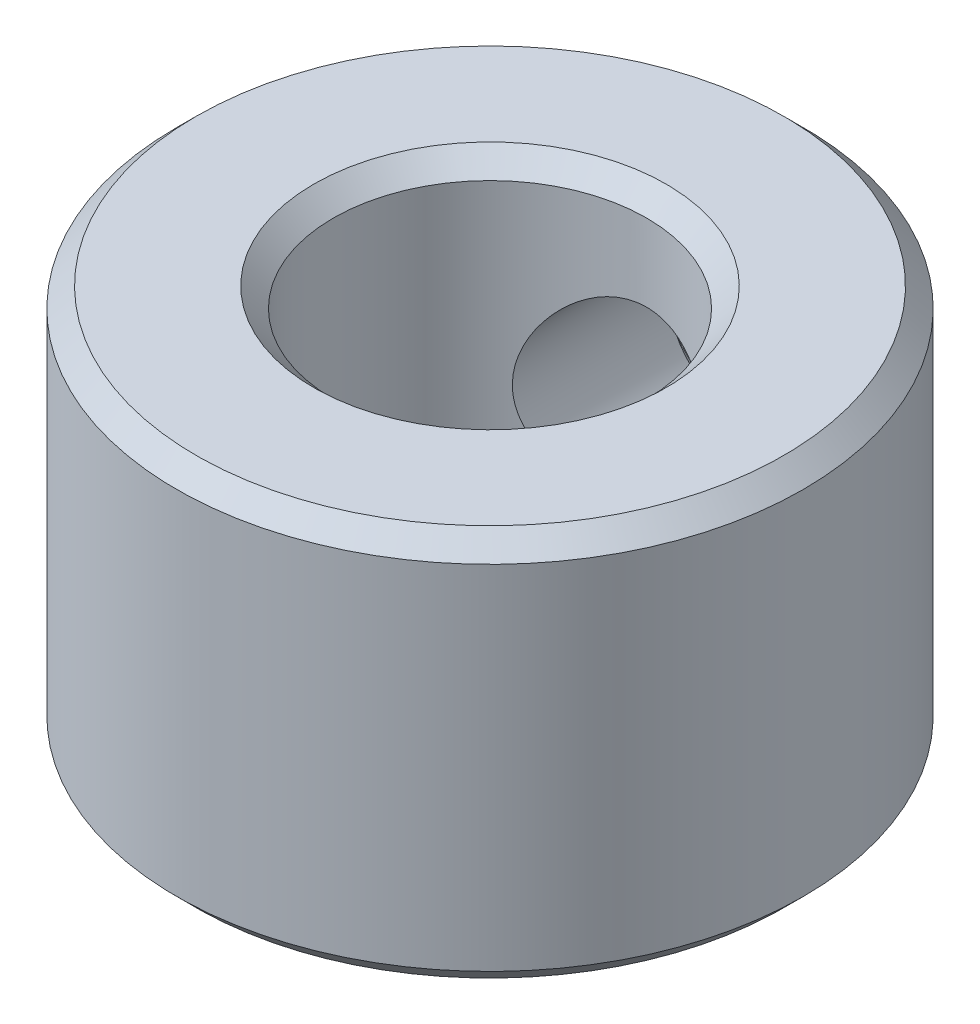
ISO-10303-21;
HEADER;
FILE_DESCRIPTION(('STEP AP214'),'2;1');
FILE_NAME('part.step','',(''),(''),'','','');
FILE_SCHEMA(('AUTOMOTIVE_DESIGN { 1 0 10303 214 1 1 1 1 }'));
ENDSEC;
DATA;
#1=APPLICATION_CONTEXT('core data for automotive mechanical design processes');
#2=APPLICATION_PROTOCOL_DEFINITION('international standard','automotive_design',2000,#1);
#3=PRODUCT_CONTEXT('',#1,'mechanical');
#4=PRODUCT('Part','Part','',(#3));
#5=PRODUCT_RELATED_PRODUCT_CATEGORY('part','',(#4));
#6=PRODUCT_DEFINITION_FORMATION('','',#4);
#7=PRODUCT_DEFINITION_CONTEXT('part definition',#1,'design');
#8=PRODUCT_DEFINITION('design','',#6,#7);
#9=PRODUCT_DEFINITION_SHAPE('','',#8);
#10=(LENGTH_UNIT() NAMED_UNIT(*) SI_UNIT(.MILLI.,.METRE.));
#11=(NAMED_UNIT(*) PLANE_ANGLE_UNIT() SI_UNIT($,.RADIAN.));
#12=(NAMED_UNIT(*) SI_UNIT($,.STERADIAN.) SOLID_ANGLE_UNIT());
#13=UNCERTAINTY_MEASURE_WITH_UNIT(LENGTH_MEASURE(1.E-05),#10,'distance_accuracy_value','');
#14=(GEOMETRIC_REPRESENTATION_CONTEXT(3) GLOBAL_UNCERTAINTY_ASSIGNED_CONTEXT((#13)) GLOBAL_UNIT_ASSIGNED_CONTEXT((#10,
#11,#12)) REPRESENTATION_CONTEXT('',''));
#15=CARTESIAN_POINT('',(0.,0.,0.));
#16=DIRECTION('',(0.,0.,1.));
#17=DIRECTION('',(1.,0.,0.));
#18=AXIS2_PLACEMENT_3D('',#15,#16,#17);
#19=CARTESIAN_POINT('',(0.,4.875,0.));
#20=DIRECTION('',(0.,1.,0.));
#21=DIRECTION('',(1.,0.,0.));
#22=AXIS2_PLACEMENT_3D('',#19,#20,#21);
#23=CONICAL_SURFACE('',#22,2.125,0.785398163397448);
#24=CARTESIAN_POINT('',(0.,5.,0.));
#25=DIRECTION('',(0.,1.,0.));
#26=DIRECTION('',(1.,0.,0.));
#27=AXIS2_PLACEMENT_3D('',#24,#25,#26);
#28=CIRCLE('',#27,2.25);
#29=CARTESIAN_POINT('',(-2.25,5.,0.));
#30=VERTEX_POINT('',#29);
#31=EDGE_CURVE('E202',#30,#30,#28,.T.);
#32=ORIENTED_EDGE('',*,*,#31,.T.);
#33=DIRECTION('',(0.707106781186547,-0.707106781186548,0.));
#34=VECTOR('',#33,1.);
#35=CARTESIAN_POINT('',(-2.125,4.875,0.));
#36=LINE('',#35,#34);
#37=CARTESIAN_POINT('',(-2.,4.75,0.));
#38=VERTEX_POINT('',#37);
#39=EDGE_CURVE('E11',#30,#38,#36,.T.);
#40=ORIENTED_EDGE('',*,*,#39,.T.);
#41=CARTESIAN_POINT('',(0.,4.75,0.));
#42=DIRECTION('',(0.,-1.,0.));
#43=DIRECTION('',(1.,0.,0.));
#44=AXIS2_PLACEMENT_3D('',#41,#42,#43);
#45=CIRCLE('',#44,2.);
#46=EDGE_CURVE('E208',#38,#38,#45,.T.);
#47=ORIENTED_EDGE('',*,*,#46,.T.);
#48=ORIENTED_EDGE('',*,*,#39,.F.);
#49=EDGE_LOOP('',(#32,#40,#47,#48));
#50=FACE_BOUND('',#49,.T.);
#51=ADVANCED_FACE('F17',(#50),#23,.F.);
#52=CARTESIAN_POINT('',(0.,0.,0.));
#53=DIRECTION('',(0.,1.,0.));
#54=DIRECTION('',(1.,0.,0.));
#55=AXIS2_PLACEMENT_3D('',#52,#53,#54);
#56=CYLINDRICAL_SURFACE('',#55,2.);
#57=CARTESIAN_POINT('',(1.2645,2.5,-1.54952888001483));
#58=CARTESIAN_POINT('',(1.26449411796691,2.43735012324644,-1.54953832528692));
#59=CARTESIAN_POINT('',(1.25980123596175,2.37460998732213,-1.55340009895582));
#60=CARTESIAN_POINT('',(1.24137298283824,2.25126618343794,-1.56815840057098));
#61=CARTESIAN_POINT('',(1.22761427551083,2.19066845550868,-1.57907308189968));
#62=CARTESIAN_POINT('',(1.19205271815077,2.07376857766439,-1.60608182446035));
#63=CARTESIAN_POINT('',(1.17032101939601,2.01743359363941,-1.62212991738661));
#64=CARTESIAN_POINT('',(1.11963684574248,1.90928453446939,-1.65751838322308));
#65=CARTESIAN_POINT('',(1.09068388775742,1.85747076209657,-1.67685897636678));
#66=CARTESIAN_POINT('',(1.02173617894958,1.75199397208212,-1.71986123397177));
#67=CARTESIAN_POINT('',(0.980769943374188,1.69905883131843,-1.7437511823403));
#68=CARTESIAN_POINT('',(0.89093919554735,1.6001925381209,-1.79131669705349));
#69=CARTESIAN_POINT('',(0.842067766194926,1.55426758868601,-1.81499205629592));
#70=CARTESIAN_POINT('',(0.730451803901077,1.465052650476,-1.86294646109463));
#71=CARTESIAN_POINT('',(0.666737528883957,1.42280305888443,-1.88693350492434));
#72=CARTESIAN_POINT('',(0.531298337879028,1.34996747456659,-1.92944044111025));
#73=CARTESIAN_POINT('',(0.459581610447951,1.31936969802778,-1.9479658526651));
#74=CARTESIAN_POINT('',(0.318000809823785,1.27412401821854,-1.97573486186531));
#75=CARTESIAN_POINT('',(0.248713007533473,1.25815324205258,-1.98574058327142));
#76=CARTESIAN_POINT('',(0.107801673786748,1.23810190006417,-1.99833990319646));
#77=CARTESIAN_POINT('',(0.0361807627911929,1.23400843009899,-2.00094154584486));
#78=CARTESIAN_POINT('',(-0.0967328525311562,1.23769823411709,-1.99861152687371));
#79=CARTESIAN_POINT('',(-0.158094030613458,1.24392864060202,-1.99466473631825));
#80=CARTESIAN_POINT('',(-0.278694570481386,1.26507623336505,-1.98141571029734));
#81=CARTESIAN_POINT('',(-0.337933771771026,1.27999407525198,-1.97211307064624));
#82=CARTESIAN_POINT('',(-0.452914762909885,1.31784031499373,-1.9489274314289));
#83=CARTESIAN_POINT('',(-0.508651031986307,1.34078100131795,-1.9350374072614));
#84=CARTESIAN_POINT('',(-0.615518921331753,1.39380889945209,-1.90374389911779));
#85=CARTESIAN_POINT('',(-0.66664952948229,1.42389767683448,-1.88633964558184));
#86=CARTESIAN_POINT('',(-0.769757581284988,1.49460510074034,-1.84685964638113));
#87=CARTESIAN_POINT('',(-0.821032566750792,1.53607218519547,-1.82447166495386));
#88=CARTESIAN_POINT('',(-0.916345547494313,1.62616876997324,-1.77851561123726));
#89=CARTESIAN_POINT('',(-0.960372651636247,1.67480884469536,-1.75494583119227));
#90=CARTESIAN_POINT('',(-1.04598643244538,1.78556668533021,-1.70548199944205));
#91=CARTESIAN_POINT('',(-1.08644277160218,1.84861743719009,-1.67970330352267));
#92=CARTESIAN_POINT('',(-1.15604990573414,1.98216587136297,-1.63258088815751));
#93=CARTESIAN_POINT('',(-1.1852213789095,2.05264962893361,-1.61122909058669));
#94=CARTESIAN_POINT('',(-1.2246161450688,2.17992201583035,-1.58137778507439));
#95=CARTESIAN_POINT('',(-1.23781972955308,2.23533731102721,-1.57096854929203));
#96=CARTESIAN_POINT('',(-1.2566505024441,2.34817824878922,-1.55594978135884));
#97=CARTESIAN_POINT('',(-1.26228851443341,2.40560089853876,-1.55133196441425));
#98=CARTESIAN_POINT('',(-1.26564578829317,2.52098806068944,-1.54859515876369));
#99=CARTESIAN_POINT('',(-1.26334448419211,2.57895359188928,-1.55049304825479));
#100=CARTESIAN_POINT('',(-1.25093577610471,2.69350884817042,-1.56051880729487));
#101=CARTESIAN_POINT('',(-1.24082186157763,2.75009738516122,-1.56865187280686));
#102=CARTESIAN_POINT('',(-1.21366943674918,2.85925861904806,-1.58974532293077));
#103=CARTESIAN_POINT('',(-1.1967843787254,2.91189147657731,-1.60259823220519));
#104=CARTESIAN_POINT('',(-1.15675412768388,3.01368807254575,-1.63172650488258));
#105=CARTESIAN_POINT('',(-1.1336067386191,3.06285058637963,-1.64800306843138));
#106=CARTESIAN_POINT('',(-1.07658218628269,3.16638258759106,-1.68592855061878));
#107=CARTESIAN_POINT('',(-1.04149675234294,3.21992850889003,-1.70800822887954));
#108=CARTESIAN_POINT('',(-0.963864401793085,3.32096981729384,-1.75299258821368));
#109=CARTESIAN_POINT('',(-0.921309629627182,3.36845874251176,-1.77589811748598));
#110=CARTESIAN_POINT('',(-0.821420704703212,3.46425733392833,-1.82451368153187));
#111=CARTESIAN_POINT('',(-0.762803985042327,3.51133859050659,-1.8500399732252));
#112=CARTESIAN_POINT('',(-0.636990044557513,3.59494194218451,-1.8970357779525));
#113=CARTESIAN_POINT('',(-0.569796236109793,3.6314682178001,-1.91850689595041));
#114=CARTESIAN_POINT('',(-0.432254308912909,3.69054688083504,-1.95394855830421));
#115=CARTESIAN_POINT('',(-0.362282006019539,3.7137564589949,-1.96826622926783));
#116=CARTESIAN_POINT('',(-0.218314556068939,3.74769609803434,-1.98937292908515));
#117=CARTESIAN_POINT('',(-0.144325456886686,3.75844440401708,-1.99617296416441));
#118=CARTESIAN_POINT('',(-0.00665707801373274,3.76606929450586,-2.00099185098277));
#119=CARTESIAN_POINT('',(0.0568858046173655,3.76480085080471,-2.0001850416096));
#120=CARTESIAN_POINT('',(0.182709540069951,3.75282403612561,-1.99263276935113));
#121=CARTESIAN_POINT('',(0.244990477096484,3.74211629713365,-1.98588770404796));
#122=CARTESIAN_POINT('',(0.364008255181647,3.712464633797,-1.96748125913666));
#123=CARTESIAN_POINT('',(0.420867567149991,3.6938735435709,-1.95603107711261));
#124=CARTESIAN_POINT('',(0.530593796569564,3.64932134254513,-1.92916148883134));
#125=CARTESIAN_POINT('',(0.58346008343398,3.62335907074123,-1.91374145733531));
#126=CARTESIAN_POINT('',(0.68954176175382,3.56189672046674,-1.8782890840866));
#127=CARTESIAN_POINT('',(0.742245311387839,3.52569494478695,-1.85794707932388));
#128=CARTESIAN_POINT('',(0.841195569530736,3.44624724224734,-1.81529603663499));
#129=CARTESIAN_POINT('',(0.887435048339554,3.40299354345176,-1.79298484104648));
#130=CARTESIAN_POINT('',(0.979270491623404,3.3032714453577,-1.7447348464483));
#131=CARTESIAN_POINT('',(1.02375166101236,3.24579451602162,-1.71874926626124));
#132=CARTESIAN_POINT('',(1.10261752614741,3.12329097722003,-1.66925222113531));
#133=CARTESIAN_POINT('',(1.1370067814702,3.05826779577634,-1.64573964197263));
#134=CARTESIAN_POINT('',(1.18818249135166,2.93651580305712,-1.60903404622307));
#135=CARTESIAN_POINT('',(1.20717019521899,2.88105495048418,-1.59470883609959));
#136=CARTESIAN_POINT('',(1.23737203476855,2.76706109813201,-1.57139495785571));
#137=CARTESIAN_POINT('',(1.24861010049216,2.70853816143648,-1.56238987421431));
#138=CARTESIAN_POINT('',(1.25859624043419,2.62456942414068,-1.55433160058593));
#139=CARTESIAN_POINT('',(1.26080597808091,2.59974838666082,-1.55253745914827));
#140=CARTESIAN_POINT('',(1.26375922886068,2.54995637712227,-1.5501340553494));
#141=CARTESIAN_POINT('',(1.26450234581071,2.52498536637754,-1.54952511315053));
#142=CARTESIAN_POINT('',(1.2645,2.5,-1.54952888001483));
#143=B_SPLINE_CURVE_WITH_KNOTS('',3,(#57,#58,#59,#60,#61,#62,#63,#64,#65,#66,#67,#68,#69,#70,
#71,#72,#73,#74,#75,#76,#77,#78,#79,#80,#81,#82,#83,#84,#85,#86,#87,#88,#89,#90,#91,#92,#93,#94,
#95,#96,#97,#98,#99,#100,#101,#102,#103,#104,#105,#106,#107,#108,#109,#110,#111,#112,#113,#114,
#115,#116,#117,#118,#119,#120,#121,#122,#123,#124,#125,#126,#127,#128,#129,#130,#131,#132,#133,
#134,#135,#136,#137,#138,#139,#140,#141,#142),.UNSPECIFIED.,.T.,.F.,(4,2,2,2,2,2,2,2,2,2,2,2,2,
2,2,2,2,2,2,2,2,2,2,2,2,2,2,2,2,2,2,2,2,2,2,2,2,2,2,2,2,2,4),(0.,0.187834998618613,
0.376155399361165,0.562834551812605,0.74952619603823,0.96192621140118,1.17451309377345,
1.41357454197133,1.65239357434149,1.86649900785851,2.08037173848349,2.26489251750059,
2.44942722342765,2.63424582532583,2.81910494351061,3.02721650045857,3.23563797985774,
3.47217432561049,3.70827516954924,3.88128567913113,4.05404840877014,4.2272589979291,
4.40061408588117,4.57024443479238,4.73993434621561,4.94234058954809,5.14496099459186,
5.38196739397222,5.618879793056,5.84278297062728,6.06635790592645,6.25605905235322,
6.44574749874689,6.62771803900912,6.80971725661148,7.01023551077349,7.21097626913794,
7.44152072744398,7.67196086369056,7.85232662520503,8.03213291238308,8.10702306777426,
8.18193345071839),.UNSPECIFIED.);
#144=CARTESIAN_POINT('',(-1.2645,2.5,-1.54952888001483));
#145=VERTEX_POINT('',#144);
#146=EDGE_CURVE('E96',#145,#145,#143,.T.);
#147=ORIENTED_EDGE('',*,*,#146,.T.);
#148=EDGE_LOOP('',(#147));
#149=FACE_BOUND('',#148,.T.);
#150=ORIENTED_EDGE('',*,*,#46,.F.);
#151=DIRECTION('',(0.,-1.,0.));
#152=VECTOR('',#151,1.);
#153=CARTESIAN_POINT('',(-2.,0.,0.));
#154=LINE('',#153,#152);
#155=CARTESIAN_POINT('',(-2.,0.25,0.));
#156=VERTEX_POINT('',#155);
#157=EDGE_CURVE('E28',#38,#156,#154,.T.);
#158=ORIENTED_EDGE('',*,*,#157,.T.);
#159=CARTESIAN_POINT('',(0.,0.25,0.));
#160=DIRECTION('',(0.,1.,0.));
#161=DIRECTION('',(1.,0.,0.));
#162=AXIS2_PLACEMENT_3D('',#159,#160,#161);
#163=CIRCLE('',#162,2.);
#164=EDGE_CURVE('E198',#156,#156,#163,.T.);
#165=ORIENTED_EDGE('',*,*,#164,.F.);
#166=ORIENTED_EDGE('',*,*,#157,.F.);
#167=EDGE_LOOP('',(#150,#158,#165,#166));
#168=FACE_BOUND('',#167,.T.);
#169=ADVANCED_FACE('F19',(#149,#168),#56,.F.);
#170=CARTESIAN_POINT('',(0.,0.125,0.));
#171=DIRECTION('',(0.,-1.,0.));
#172=DIRECTION('',(1.,0.,0.));
#173=AXIS2_PLACEMENT_3D('',#170,#171,#172);
#174=CONICAL_SURFACE('',#173,2.125,0.785398163397448);
#175=ORIENTED_EDGE('',*,*,#164,.T.);
#176=DIRECTION('',(-0.707106781186547,-0.707106781186548,0.));
#177=VECTOR('',#176,1.);
#178=CARTESIAN_POINT('',(-2.125,0.125,0.));
#179=LINE('',#178,#177);
#180=CARTESIAN_POINT('',(-2.25,0.,0.));
#181=VERTEX_POINT('',#180);
#182=EDGE_CURVE('E200',#156,#181,#179,.T.);
#183=ORIENTED_EDGE('',*,*,#182,.T.);
#184=CARTESIAN_POINT('',(0.,0.,0.));
#185=DIRECTION('',(0.,-1.,0.));
#186=DIRECTION('',(1.,0.,0.));
#187=AXIS2_PLACEMENT_3D('',#184,#185,#186);
#188=CIRCLE('',#187,2.25);
#189=EDGE_CURVE('E225',#181,#181,#188,.T.);
#190=ORIENTED_EDGE('',*,*,#189,.T.);
#191=ORIENTED_EDGE('',*,*,#182,.F.);
#192=EDGE_LOOP('',(#175,#183,#190,#191));
#193=FACE_BOUND('',#192,.T.);
#194=ADVANCED_FACE('F176',(#193),#174,.F.);
#195=CARTESIAN_POINT('',(0.,5.,0.));
#196=DIRECTION('',(0.,1.,0.));
#197=DIRECTION('',(1.,0.,0.));
#198=AXIS2_PLACEMENT_3D('',#195,#196,#197);
#199=PLANE('',#198);
#200=ORIENTED_EDGE('',*,*,#31,.F.);
#201=EDGE_LOOP('',(#200));
#202=FACE_BOUND('',#201,.T.);
#203=CARTESIAN_POINT('',(0.,5.,0.));
#204=DIRECTION('',(0.,-1.,0.));
#205=DIRECTION('',(1.,0.,0.));
#206=AXIS2_PLACEMENT_3D('',#203,#204,#205);
#207=CIRCLE('',#206,3.75);
#208=CARTESIAN_POINT('',(-3.75,5.,0.));
#209=VERTEX_POINT('',#208);
#210=EDGE_CURVE('E221',#209,#209,#207,.T.);
#211=ORIENTED_EDGE('',*,*,#210,.F.);
#212=EDGE_LOOP('',(#211));
#213=FACE_BOUND('',#212,.T.);
#214=ADVANCED_FACE('F183',(#202,#213),#199,.T.);
#215=CARTESIAN_POINT('',(0.,4.875,0.));
#216=DIRECTION('',(0.,-1.,0.));
#217=DIRECTION('',(1.,0.,0.));
#218=AXIS2_PLACEMENT_3D('',#215,#216,#217);
#219=CONICAL_SURFACE('',#218,3.875,0.785398163397448);
#220=ORIENTED_EDGE('',*,*,#210,.T.);
#221=DIRECTION('',(-0.707106781186548,-0.707106781186548,0.));
#222=VECTOR('',#221,1.);
#223=CARTESIAN_POINT('',(-3.875,4.875,0.));
#224=LINE('',#223,#222);
#225=CARTESIAN_POINT('',(-4.,4.75,0.));
#226=VERTEX_POINT('',#225);
#227=EDGE_CURVE('E210',#209,#226,#224,.T.);
#228=ORIENTED_EDGE('',*,*,#227,.T.);
#229=CARTESIAN_POINT('',(0.,4.75,0.));
#230=DIRECTION('',(0.,1.,0.));
#231=DIRECTION('',(1.,0.,0.));
#232=AXIS2_PLACEMENT_3D('',#229,#230,#231);
#233=CIRCLE('',#232,4.);
#234=EDGE_CURVE('E150',#226,#226,#233,.T.);
#235=ORIENTED_EDGE('',*,*,#234,.T.);
#236=ORIENTED_EDGE('',*,*,#227,.F.);
#237=EDGE_LOOP('',(#220,#228,#235,#236));
#238=FACE_BOUND('',#237,.T.);
#239=ADVANCED_FACE('F179',(#238),#219,.T.);
#240=CARTESIAN_POINT('',(0.,0.,0.));
#241=DIRECTION('',(0.,1.,0.));
#242=DIRECTION('',(1.,0.,0.));
#243=AXIS2_PLACEMENT_3D('',#240,#241,#242);
#244=PLANE('',#243);
#245=ORIENTED_EDGE('',*,*,#189,.F.);
#246=EDGE_LOOP('',(#245));
#247=FACE_BOUND('',#246,.T.);
#248=CARTESIAN_POINT('',(0.,0.,0.));
#249=DIRECTION('',(0.,1.,0.));
#250=DIRECTION('',(1.,0.,0.));
#251=AXIS2_PLACEMENT_3D('',#248,#249,#250);
#252=CIRCLE('',#251,3.75);
#253=CARTESIAN_POINT('',(-3.75,0.,0.));
#254=VERTEX_POINT('',#253);
#255=EDGE_CURVE('E229',#254,#254,#252,.T.);
#256=ORIENTED_EDGE('',*,*,#255,.F.);
#257=EDGE_LOOP('',(#256));
#258=FACE_BOUND('',#257,.T.);
#259=ADVANCED_FACE('F182',(#247,#258),#244,.F.);
#260=CARTESIAN_POINT('',(0.,0.125,0.));
#261=DIRECTION('',(0.,1.,0.));
#262=DIRECTION('',(1.,0.,0.));
#263=AXIS2_PLACEMENT_3D('',#260,#261,#262);
#264=CONICAL_SURFACE('',#263,3.875,0.785398163397449);
#265=CARTESIAN_POINT('',(0.,0.25,0.));
#266=DIRECTION('',(0.,-1.,0.));
#267=DIRECTION('',(1.,0.,0.));
#268=AXIS2_PLACEMENT_3D('',#265,#266,#267);
#269=CIRCLE('',#268,4.);
#270=CARTESIAN_POINT('',(-4.,0.25,0.));
#271=VERTEX_POINT('',#270);
#272=EDGE_CURVE('E216',#271,#271,#269,.T.);
#273=ORIENTED_EDGE('',*,*,#272,.T.);
#274=DIRECTION('',(0.707106781186548,-0.707106781186547,0.));
#275=VECTOR('',#274,1.);
#276=CARTESIAN_POINT('',(-3.875,0.125,0.));
#277=LINE('',#276,#275);
#278=EDGE_CURVE('E220',#271,#254,#277,.T.);
#279=ORIENTED_EDGE('',*,*,#278,.T.);
#280=ORIENTED_EDGE('',*,*,#255,.T.);
#281=ORIENTED_EDGE('',*,*,#278,.F.);
#282=EDGE_LOOP('',(#273,#279,#280,#281));
#283=FACE_BOUND('',#282,.T.);
#284=ADVANCED_FACE('F170',(#283),#264,.T.);
#285=CARTESIAN_POINT('',(0.,0.,0.));
#286=DIRECTION('',(0.,1.,0.));
#287=DIRECTION('',(1.,0.,0.));
#288=AXIS2_PLACEMENT_3D('',#285,#286,#287);
#289=CYLINDRICAL_SURFACE('',#288,4.);
#290=CARTESIAN_POINT('',(-1.49909382170273,2.5,-3.70846568188599));
#291=CARTESIAN_POINT('',(-1.49909382170273,2.72089732128893,-3.70846568188599));
#292=CARTESIAN_POINT('',(-1.38922205118641,3.19635642810341,-3.75235090255221));
#293=CARTESIAN_POINT('',(-0.83670897618908,3.89780784607125,-3.94334263837228));
#294=CARTESIAN_POINT('',(0.134475216136004,4.14246029251629,-4.05059755334012));
#295=CARTESIAN_POINT('',(0.877762587617222,3.76473716202204,-3.90863752858632));
#296=CARTESIAN_POINT('',(1.17855956450457,3.46068884661615,-3.82497921274844));
#297=CARTESIAN_POINT('',(1.42325993677328,3.06780020018476,-3.74155425360215));
#298=CARTESIAN_POINT('',(1.54874891459138,2.5047164954535,-3.68554379966131));
#299=CARTESIAN_POINT('',(1.34579703618987,1.58050804657097,-3.77692919929063));
#300=CARTESIAN_POINT('',(0.58671246259579,0.976733181262446,-4.00522023908345));
#301=CARTESIAN_POINT('',(-0.344933753518193,0.971338670866824,-4.00467209967727));
#302=CARTESIAN_POINT('',(-0.980947661805724,1.28301447876608,-3.8915658372877));
#303=CARTESIAN_POINT('',(-1.38467666273256,1.80064474179365,-3.75513782088051));
#304=CARTESIAN_POINT('',(-1.49909382170273,2.27910267871108,-3.70846568188599));
#305=CARTESIAN_POINT('',(-1.49909382170273,2.5,-3.70846568188599));
#306=(BOUNDED_CURVE() B_SPLINE_CURVE(3,(#290,#291,#292,#293,#294,#295,#296,#297,#298,#299,#300,
#301,#302,#303,#304,#305),.UNSPECIFIED.,.T.,.F.) B_SPLINE_CURVE_WITH_KNOTS((4,1,1,1,1,1,1,1,1,1,
1,1,1,4),(0.,0.0548453600584061,0.109690720116813,0.219381440233627,0.274226800292034,
0.301649480321237,0.329072160350441,0.383917520408847,0.438762880467254,0.548453600584068,
0.603298960642475,0.658144320700881,0.712989680759288,0.767835040817695),
.UNSPECIFIED.) CURVE() GEOMETRIC_REPRESENTATION_ITEM() RATIONAL_B_SPLINE_CURVE((1.,1.,1.,1.,1.,
1.,1.,1.,1.,1.,1.,1.,1.,1.,1.,1.)) REPRESENTATION_ITEM(''));
#307=CARTESIAN_POINT('',(-1.49909382170353,2.5,-3.70846568188655));
#308=VERTEX_POINT('',#307);
#309=EDGE_CURVE('E88',#308,#308,#306,.T.);
#310=ORIENTED_EDGE('',*,*,#309,.F.);
#311=EDGE_LOOP('',(#310));
#312=FACE_BOUND('',#311,.T.);
#313=ORIENTED_EDGE('',*,*,#234,.F.);
#314=DIRECTION('',(0.,-1.,0.));
#315=VECTOR('',#314,1.);
#316=CARTESIAN_POINT('',(-4.,0.,0.));
#317=LINE('',#316,#315);
#318=EDGE_CURVE('E158',#226,#271,#317,.T.);
#319=ORIENTED_EDGE('',*,*,#318,.T.);
#320=ORIENTED_EDGE('',*,*,#272,.F.);
#321=ORIENTED_EDGE('',*,*,#318,.F.);
#322=EDGE_LOOP('',(#313,#319,#320,#321));
#323=FACE_BOUND('',#322,.T.);
#324=ADVANCED_FACE('F165',(#312,#323),#289,.T.);
#325=CARTESIAN_POINT('',(0.,2.5,0.));
#326=DIRECTION('',(0.,0.,-1.));
#327=DIRECTION('',(1.,0.,0.));
#328=AXIS2_PLACEMENT_3D('',#325,#326,#327);
#329=CYLINDRICAL_SURFACE('',#328,1.2645);
#330=ORIENTED_EDGE('',*,*,#146,.F.);
#331=DIRECTION('',(0.,0.,-1.));
#332=VECTOR('',#331,1.);
#333=CARTESIAN_POINT('',(-1.2645,2.5,0.));
#334=LINE('',#333,#332);
#335=CARTESIAN_POINT('',(-1.2645,2.5,-3.54487018882069));
#336=VERTEX_POINT('',#335);
#337=EDGE_CURVE('E143',#145,#336,#334,.T.);
#338=ORIENTED_EDGE('',*,*,#337,.T.);
#339=CARTESIAN_POINT('',(-1.2645,2.5,-3.54487018882069));
#340=CARTESIAN_POINT('',(-1.2645,2.30513838343412,-3.54487018882069));
#341=CARTESIAN_POINT('',(-1.15345052099916,1.88446936891256,-3.57970347471206));
#342=CARTESIAN_POINT('',(-0.786408014453958,1.45704909304605,-3.67834808926274));
#343=CARTESIAN_POINT('',(-0.265009806986551,1.2252731657563,-3.75286596992555));
#344=CARTESIAN_POINT('',(0.447537665195123,1.22598802030911,-3.75513969316828));
#345=CARTESIAN_POINT('',(1.11012956348669,1.68773755547493,-3.5972577942593));
#346=CARTESIAN_POINT('',(1.31564721330752,2.50481059416571,-3.52710582475938));
#347=CARTESIAN_POINT('',(1.18951754981533,3.00031332352077,-3.56982230561473));
#348=CARTESIAN_POINT('',(0.966644388217517,3.33074133040212,-3.62998545166653));
#349=CARTESIAN_POINT('',(0.700913744542567,3.57814661811471,-3.68941528329172));
#350=CARTESIAN_POINT('',(0.0977762955579307,3.85760231497487,-3.78324886983267));
#351=CARTESIAN_POINT('',(-0.650957008547244,3.68817240149751,-3.71447903576025));
#352=CARTESIAN_POINT('',(-1.15935930369818,3.11493574902256,-3.57827749934624));
#353=CARTESIAN_POINT('',(-1.2645,2.69486161656589,-3.54487018882069));
#354=CARTESIAN_POINT('',(-1.2645,2.5,-3.54487018882069));
#355=(BOUNDED_CURVE() B_SPLINE_CURVE(3,(#339,#340,#341,#342,#343,#344,#345,#346,#347,#348,#349,
#350,#351,#352,#353,#354),.UNSPECIFIED.,.T.,.F.) B_SPLINE_CURVE_WITH_KNOTS((4,1,1,1,1,1,1,1,1,1,
1,1,1,4),(0.,0.0548453600584068,0.109690720116814,0.16453608017522,0.219381440233627,
0.329072160350441,0.383917520408848,0.438762880467254,0.466185560496458,0.493608240525661,
0.548453600584068,0.658144320700882,0.712989680759289,0.767835040817695),
.UNSPECIFIED.) CURVE() GEOMETRIC_REPRESENTATION_ITEM() RATIONAL_B_SPLINE_CURVE((1.,1.,1.,1.,1.,
1.,1.,1.,1.,1.,1.,1.,1.,1.,1.,1.)) REPRESENTATION_ITEM(''));
#356=EDGE_CURVE('E97',#336,#336,#355,.T.);
#357=ORIENTED_EDGE('',*,*,#356,.F.);
#358=ORIENTED_EDGE('',*,*,#337,.F.);
#359=EDGE_LOOP('',(#330,#338,#357,#358));
#360=FACE_BOUND('',#359,.T.);
#361=ADVANCED_FACE('F118',(#360),#329,.F.);
#362=CARTESIAN_POINT('',(-1.49909382170353,2.5,-3.70846568188655));
#363=CARTESIAN_POINT('',(-1.49909382170353,2.27910267871099,-3.70846568188655));
#364=CARTESIAN_POINT('',(-1.38467666273335,1.80064474179336,-3.75513782088111));
#365=CARTESIAN_POINT('',(-0.980947661806387,1.28301447876549,-3.89156583728843));
#366=CARTESIAN_POINT('',(-0.344933753518465,0.971338670865958,-4.00467209967813));
#367=CARTESIAN_POINT('',(0.586712462596265,0.976733181261597,-4.0052202390843));
#368=CARTESIAN_POINT('',(1.34579703619067,1.5805080465706,-3.77692919929124));
#369=CARTESIAN_POINT('',(1.54874891459217,2.5047164954535,-3.68554379966185));
#370=CARTESIAN_POINT('',(1.42325993677408,3.06780020018499,-3.74155425360274));
#371=CARTESIAN_POINT('',(1.17855956450529,3.46068884661659,-3.8249792127491));
#372=CARTESIAN_POINT('',(0.877762587617825,3.76473716202268,-3.90863752858707));
#373=CARTESIAN_POINT('',(0.134475216136129,4.14246029251726,-4.05059755334103));
#374=CARTESIAN_POINT('',(-0.836708976189713,3.89780784607197,-3.94334263837306));
#375=CARTESIAN_POINT('',(-1.38922205118719,3.19635642810369,-3.7523509025528));
#376=CARTESIAN_POINT('',(-1.49909382170353,2.72089732128902,-3.70846568188655));
#377=CARTESIAN_POINT('',(-1.49909382170353,2.5,-3.70846568188655));
#378=CARTESIAN_POINT('',(-1.42089588113569,2.5,-3.6539338508646));
#379=CARTESIAN_POINT('',(-1.42089588113569,2.28778124695203,-3.6539338508646));
#380=CARTESIAN_POINT('',(-1.30760128215528,1.82858628416643,-3.69665970549143));
#381=CARTESIAN_POINT('',(-0.91610111268891,1.34102601685901,-3.8204932546132));
#382=CARTESIAN_POINT('',(-0.318292438007827,1.05598350249607,-3.92073672309394));
#383=CARTESIAN_POINT('',(0.540320863462551,1.05981812761077,-3.92186005711229));
#384=CARTESIAN_POINT('',(1.26724121195601,1.61625121620538,-3.71703873094726));
#385=CARTESIAN_POINT('',(1.47104834749729,2.5047478616909,-3.63273114136103));
#386=CARTESIAN_POINT('',(1.34534580778783,3.04530457463024,-3.68431027094007));
#387=CARTESIAN_POINT('',(1.10792117240936,3.41737300787843,-3.75998129238824));
#388=CARTESIAN_POINT('',(0.818812973259405,3.70254031405335,-3.83556344682196));
#389=CARTESIAN_POINT('',(0.122242242610064,4.04750763333646,-3.96148132550491));
#390=CARTESIAN_POINT('',(-0.774791653642223,3.82792936454715,-3.86705477083546));
#391=CARTESIAN_POINT('',(-1.31260113535752,3.16921620174331,-3.69432643481728));
#392=CARTESIAN_POINT('',(-1.42089588113569,2.71221875304797,-3.6539338508646));
#393=CARTESIAN_POINT('',(-1.42089588113569,2.5,-3.6539338508646));
#394=CARTESIAN_POINT('',(-1.34269794056784,2.5,-3.59940201984265));
#395=CARTESIAN_POINT('',(-1.34269794056784,2.29645981519307,-3.59940201984265));
#396=CARTESIAN_POINT('',(-1.23052590157722,1.85652782653949,-3.63818159010174));
#397=CARTESIAN_POINT('',(-0.851254563571434,1.39903755495253,-3.74942067193797));
#398=CARTESIAN_POINT('',(-0.291651122497189,1.14062833412619,-3.83680134650975));
#399=CARTESIAN_POINT('',(0.493929264328837,1.14290307395994,-3.83849987514029));
#400=CARTESIAN_POINT('',(1.18868538772135,1.65199438584016,-3.65714826260328));
#401=CARTESIAN_POINT('',(1.39334778040241,2.50477922792831,-3.5799184830602));
#402=CARTESIAN_POINT('',(1.26743167880158,3.02280894907551,-3.6270662882774));
#403=CARTESIAN_POINT('',(1.03728278031344,3.37405716914028,-3.69498337202739));
#404=CARTESIAN_POINT('',(0.759863358900986,3.64034346608403,-3.76248936505684));
#405=CARTESIAN_POINT('',(0.110009269083997,3.95255497415567,-3.87236509766879));
#406=CARTESIAN_POINT('',(-0.712874331094734,3.75805088302233,-3.79076690329786));
#407=CARTESIAN_POINT('',(-1.23598021952785,3.14207597538294,-3.63630196708176));
#408=CARTESIAN_POINT('',(-1.34269794056784,2.70354018480693,-3.59940201984265));
#409=CARTESIAN_POINT('',(-1.34269794056784,2.5,-3.59940201984265));
#410=CARTESIAN_POINT('',(-1.2645,2.5,-3.54487018882069));
#411=CARTESIAN_POINT('',(-1.2645,2.30513838343412,-3.54487018882069));
#412=CARTESIAN_POINT('',(-1.15345052099916,1.88446936891256,-3.57970347471206));
#413=CARTESIAN_POINT('',(-0.786408014453958,1.45704909304605,-3.67834808926274));
#414=CARTESIAN_POINT('',(-0.265009806986551,1.2252731657563,-3.75286596992555));
#415=CARTESIAN_POINT('',(0.447537665195123,1.22598802030911,-3.75513969316828));
#416=CARTESIAN_POINT('',(1.11012956348669,1.68773755547493,-3.5972577942593));
#417=CARTESIAN_POINT('',(1.31564721330752,2.50481059416571,-3.52710582475938));
#418=CARTESIAN_POINT('',(1.18951754981533,3.00031332352077,-3.56982230561473));
#419=CARTESIAN_POINT('',(0.966644388217517,3.33074133040212,-3.62998545166653));
#420=CARTESIAN_POINT('',(0.700913744542567,3.57814661811471,-3.68941528329172));
#421=CARTESIAN_POINT('',(0.0977762955579307,3.85760231497487,-3.78324886983267));
#422=CARTESIAN_POINT('',(-0.650957008547244,3.68817240149751,-3.71447903576025));
#423=CARTESIAN_POINT('',(-1.15935930369818,3.11493574902256,-3.57827749934624));
#424=CARTESIAN_POINT('',(-1.2645,2.69486161656589,-3.54487018882069));
#425=CARTESIAN_POINT('',(-1.2645,2.5,-3.54487018882069));
#426=(BOUNDED_SURFACE() B_SPLINE_SURFACE(3,3,((#362,#363,#364,#365,#366,#367,#368,#369,#370,
#371,#372,#373,#374,#375,#376,#377),(#378,#379,#380,#381,#382,#383,#384,#385,#386,#387,#388,
#389,#390,#391,#392,#393),(#394,#395,#396,#397,#398,#399,#400,#401,#402,#403,#404,#405,#406,
#407,#408,#409),(#410,#411,#412,#413,#414,#415,#416,#417,#418,#419,#420,#421,#422,#423,#424,
#425)),.UNSPECIFIED.,.F.,.T.,.F.) B_SPLINE_SURFACE_WITH_KNOTS((4,4),(4,1,1,1,1,1,1,1,1,1,1,1,1,
4),(0.,1.),(0.,0.0548453600584068,0.109690720116814,0.16453608017522,0.219381440233627,
0.329072160350441,0.383917520408848,0.438762880467254,0.466185560496458,0.493608240525661,
0.548453600584068,0.658144320700882,0.712989680759289,0.767835040817695),
.UNSPECIFIED.) GEOMETRIC_REPRESENTATION_ITEM() RATIONAL_B_SPLINE_SURFACE(((1.,1.,1.,1.,1.,1.,1.,
1.,1.,1.,1.,1.,1.,1.,1.,1.),(1.,1.,1.,1.,1.,1.,1.,1.,1.,1.,1.,1.,1.,1.,1.,1.),(1.,1.,1.,1.,1.,
1.,1.,1.,1.,1.,1.,1.,1.,1.,1.,1.),(1.,1.,1.,1.,1.,1.,1.,1.,1.,1.,1.,1.,1.,1.,1.,1.))) REPRESENTATION_ITEM('') SURFACE());
#427=DIRECTION('',(0.820249360785047,0.,0.5720061067259));
#428=VECTOR('',#427,1.);
#429=CARTESIAN_POINT('',(-1.49909382170353,2.5,-3.70846568188655));
#430=LINE('',#429,#428);
#431=EDGE_CURVE('E92',#308,#336,#430,.T.);
#432=ORIENTED_EDGE('',*,*,#431,.T.);
#433=ORIENTED_EDGE('',*,*,#356,.T.);
#434=ORIENTED_EDGE('',*,*,#431,.F.);
#435=ORIENTED_EDGE('',*,*,#309,.T.);
#436=EDGE_LOOP('',(#432,#433,#434,#435));
#437=FACE_BOUND('',#436,.T.);
#438=ADVANCED_FACE('F90',(#437),#426,.T.);
#439=CLOSED_SHELL('',(#51,#169,#194,#214,#239,#259,#284,#324,#361,#438));
#440=MANIFOLD_SOLID_BREP('B1',#439);
#441=ADVANCED_BREP_SHAPE_REPRESENTATION('',(#18,#440),#14);
#442=SHAPE_DEFINITION_REPRESENTATION(#9,#441);
ENDSEC;
END-ISO-10303-21;
